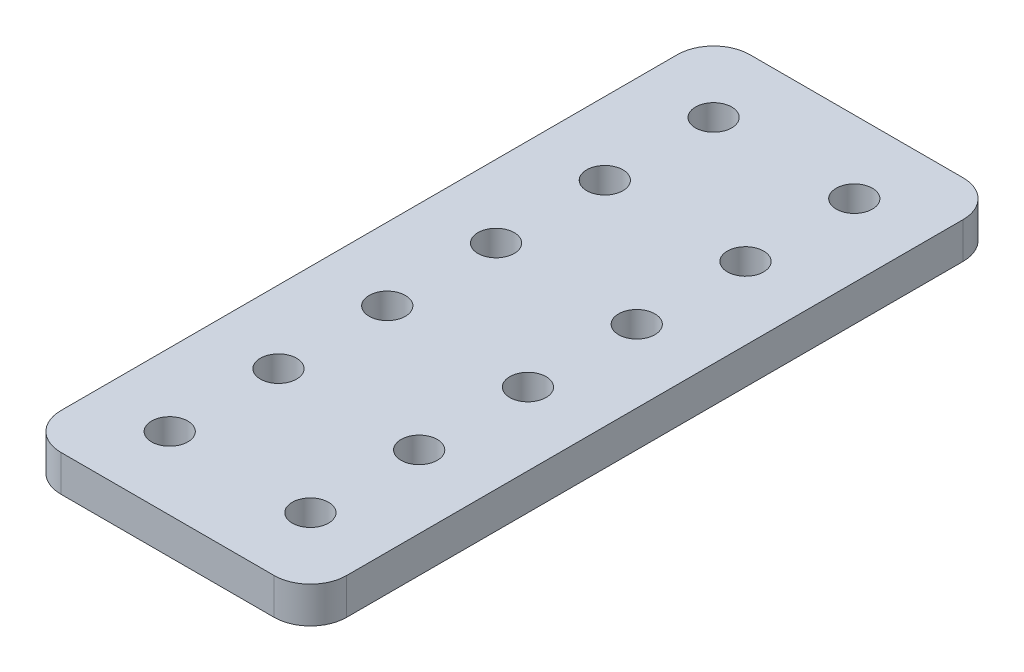
ISO-10303-21;
HEADER;
FILE_DESCRIPTION(('STEP AP214'),'2;1');
FILE_NAME('part.step','',(''),(''),'','','');
FILE_SCHEMA(('AUTOMOTIVE_DESIGN { 1 0 10303 214 1 1 1 1 }'));
ENDSEC;
DATA;
#1=APPLICATION_CONTEXT('core data for automotive mechanical design processes');
#2=APPLICATION_PROTOCOL_DEFINITION('international standard','automotive_design',2000,#1);
#3=PRODUCT_CONTEXT('',#1,'mechanical');
#4=PRODUCT('Part','Part','',(#3));
#5=PRODUCT_RELATED_PRODUCT_CATEGORY('part','',(#4));
#6=PRODUCT_DEFINITION_FORMATION('','',#4);
#7=PRODUCT_DEFINITION_CONTEXT('part definition',#1,'design');
#8=PRODUCT_DEFINITION('design','',#6,#7);
#9=PRODUCT_DEFINITION_SHAPE('','',#8);
#10=(LENGTH_UNIT() NAMED_UNIT(*) SI_UNIT(.MILLI.,.METRE.));
#11=(NAMED_UNIT(*) PLANE_ANGLE_UNIT() SI_UNIT($,.RADIAN.));
#12=(NAMED_UNIT(*) SI_UNIT($,.STERADIAN.) SOLID_ANGLE_UNIT());
#13=UNCERTAINTY_MEASURE_WITH_UNIT(LENGTH_MEASURE(1.E-05),#10,'distance_accuracy_value','');
#14=(GEOMETRIC_REPRESENTATION_CONTEXT(3) GLOBAL_UNCERTAINTY_ASSIGNED_CONTEXT((#13)) GLOBAL_UNIT_ASSIGNED_CONTEXT((#10,
#11,#12)) REPRESENTATION_CONTEXT('',''));
#15=CARTESIAN_POINT('',(0.,0.,0.));
#16=DIRECTION('',(0.,0.,1.));
#17=DIRECTION('',(1.,0.,0.));
#18=AXIS2_PLACEMENT_3D('',#15,#16,#17);
#19=CARTESIAN_POINT('',(0.,6.35,0.));
#20=DIRECTION('',(0.,-1.,0.));
#21=DIRECTION('',(0.,0.,-1.));
#22=AXIS2_PLACEMENT_3D('',#19,#20,#21);
#23=PLANE('',#22);
#24=DIRECTION('',(1.,0.,0.));
#25=VECTOR('',#24,1.);
#26=CARTESIAN_POINT('',(-25.019,6.35,60.325));
#27=LINE('',#26,#25);
#28=CARTESIAN_POINT('',(-18.669,6.35,60.325));
#29=VERTEX_POINT('',#28);
#30=CARTESIAN_POINT('',(18.669,6.35,60.325));
#31=VERTEX_POINT('',#30);
#32=EDGE_CURVE('E148',#29,#31,#27,.T.);
#33=ORIENTED_EDGE('',*,*,#32,.T.);
#34=CARTESIAN_POINT('',(18.669,6.35,53.975));
#35=DIRECTION('',(0.,-1.,0.));
#36=DIRECTION('',(0.,0.,-1.));
#37=AXIS2_PLACEMENT_3D('',#34,#35,#36);
#38=CIRCLE('',#37,6.35);
#39=CARTESIAN_POINT('',(25.019,6.35,53.975));
#40=VERTEX_POINT('',#39);
#41=EDGE_CURVE('E178',#31,#40,#38,.F.);
#42=ORIENTED_EDGE('',*,*,#41,.T.);
#43=DIRECTION('',(0.,0.,-1.));
#44=VECTOR('',#43,1.);
#45=CARTESIAN_POINT('',(25.019,6.35,60.325));
#46=LINE('',#45,#44);
#47=CARTESIAN_POINT('',(25.019,6.35,-53.975));
#48=VERTEX_POINT('',#47);
#49=EDGE_CURVE('E127',#40,#48,#46,.T.);
#50=ORIENTED_EDGE('',*,*,#49,.T.);
#51=CARTESIAN_POINT('',(18.669,6.35,-53.975));
#52=DIRECTION('',(0.,-1.,0.));
#53=DIRECTION('',(0.,0.,-1.));
#54=AXIS2_PLACEMENT_3D('',#51,#52,#53);
#55=CIRCLE('',#54,6.35);
#56=CARTESIAN_POINT('',(18.669,6.35,-60.325));
#57=VERTEX_POINT('',#56);
#58=EDGE_CURVE('E170',#48,#57,#55,.F.);
#59=ORIENTED_EDGE('',*,*,#58,.T.);
#60=DIRECTION('',(-1.,0.,0.));
#61=VECTOR('',#60,1.);
#62=CARTESIAN_POINT('',(-25.019,6.35,-60.325));
#63=LINE('',#62,#61);
#64=CARTESIAN_POINT('',(-18.669,6.35,-60.325));
#65=VERTEX_POINT('',#64);
#66=EDGE_CURVE('E193',#57,#65,#63,.T.);
#67=ORIENTED_EDGE('',*,*,#66,.T.);
#68=CARTESIAN_POINT('',(-18.669,6.35,-53.975));
#69=DIRECTION('',(0.,-1.,0.));
#70=DIRECTION('',(0.,0.,-1.));
#71=AXIS2_PLACEMENT_3D('',#68,#69,#70);
#72=CIRCLE('',#71,6.35);
#73=CARTESIAN_POINT('',(-25.019,6.35,-53.975));
#74=VERTEX_POINT('',#73);
#75=EDGE_CURVE('E62',#65,#74,#72,.F.);
#76=ORIENTED_EDGE('',*,*,#75,.T.);
#77=DIRECTION('',(0.,0.,1.));
#78=VECTOR('',#77,1.);
#79=CARTESIAN_POINT('',(-25.019,6.35,60.325));
#80=LINE('',#79,#78);
#81=CARTESIAN_POINT('',(-25.019,6.35,53.975));
#82=VERTEX_POINT('',#81);
#83=EDGE_CURVE('E201',#74,#82,#80,.T.);
#84=ORIENTED_EDGE('',*,*,#83,.T.);
#85=CARTESIAN_POINT('',(-18.669,6.35,53.975));
#86=DIRECTION('',(0.,-1.,0.));
#87=DIRECTION('',(0.,0.,-1.));
#88=AXIS2_PLACEMENT_3D('',#85,#86,#87);
#89=CIRCLE('',#88,6.35);
#90=EDGE_CURVE('E175',#82,#29,#89,.F.);
#91=ORIENTED_EDGE('',*,*,#90,.T.);
#92=EDGE_LOOP('',(#33,#42,#50,#59,#67,#76,#84,#91));
#93=FACE_BOUND('',#92,.T.);
#94=CARTESIAN_POINT('',(12.319,6.35,47.625));
#95=DIRECTION('',(0.,1.,0.));
#96=DIRECTION('',(0.,0.,1.));
#97=AXIS2_PLACEMENT_3D('',#94,#95,#96);
#98=CIRCLE('',#97,3.175);
#99=CARTESIAN_POINT('',(12.319,6.35,50.8));
#100=VERTEX_POINT('',#99);
#101=EDGE_CURVE('E137',#100,#100,#98,.T.);
#102=ORIENTED_EDGE('',*,*,#101,.F.);
#103=EDGE_LOOP('',(#102));
#104=FACE_BOUND('',#103,.T.);
#105=CARTESIAN_POINT('',(-12.319,6.35,47.625));
#106=DIRECTION('',(0.,1.,0.));
#107=DIRECTION('',(0.,0.,1.));
#108=AXIS2_PLACEMENT_3D('',#105,#106,#107);
#109=CIRCLE('',#108,3.175);
#110=CARTESIAN_POINT('',(-12.319,6.35,50.8));
#111=VERTEX_POINT('',#110);
#112=EDGE_CURVE('E213',#111,#111,#109,.T.);
#113=ORIENTED_EDGE('',*,*,#112,.F.);
#114=EDGE_LOOP('',(#113));
#115=FACE_BOUND('',#114,.T.);
#116=CARTESIAN_POINT('',(12.3189999999999,6.35,28.575));
#117=DIRECTION('',(0.,1.,0.));
#118=DIRECTION('',(0.,0.,1.));
#119=AXIS2_PLACEMENT_3D('',#116,#117,#118);
#120=CIRCLE('',#119,3.175);
#121=CARTESIAN_POINT('',(12.3189999999999,6.35,31.75));
#122=VERTEX_POINT('',#121);
#123=EDGE_CURVE('E219',#122,#122,#120,.T.);
#124=ORIENTED_EDGE('',*,*,#123,.F.);
#125=EDGE_LOOP('',(#124));
#126=FACE_BOUND('',#125,.T.);
#127=CARTESIAN_POINT('',(-12.3190000000001,6.35,28.575));
#128=DIRECTION('',(0.,1.,0.));
#129=DIRECTION('',(0.,0.,1.));
#130=AXIS2_PLACEMENT_3D('',#127,#128,#129);
#131=CIRCLE('',#130,3.175);
#132=CARTESIAN_POINT('',(-12.3190000000001,6.35,31.75));
#133=VERTEX_POINT('',#132);
#134=EDGE_CURVE('E227',#133,#133,#131,.T.);
#135=ORIENTED_EDGE('',*,*,#134,.F.);
#136=EDGE_LOOP('',(#135));
#137=FACE_BOUND('',#136,.T.);
#138=CARTESIAN_POINT('',(12.3189999999999,6.35,9.525));
#139=DIRECTION('',(0.,1.,0.));
#140=DIRECTION('',(0.,0.,1.));
#141=AXIS2_PLACEMENT_3D('',#138,#139,#140);
#142=CIRCLE('',#141,3.175);
#143=CARTESIAN_POINT('',(12.3189999999999,6.35,12.7));
#144=VERTEX_POINT('',#143);
#145=EDGE_CURVE('E235',#144,#144,#142,.T.);
#146=ORIENTED_EDGE('',*,*,#145,.F.);
#147=EDGE_LOOP('',(#146));
#148=FACE_BOUND('',#147,.T.);
#149=CARTESIAN_POINT('',(-12.3190000000001,6.35,9.525));
#150=DIRECTION('',(0.,1.,0.));
#151=DIRECTION('',(0.,0.,1.));
#152=AXIS2_PLACEMENT_3D('',#149,#150,#151);
#153=CIRCLE('',#152,3.175);
#154=CARTESIAN_POINT('',(-12.3190000000001,6.35,12.7));
#155=VERTEX_POINT('',#154);
#156=EDGE_CURVE('E243',#155,#155,#153,.T.);
#157=ORIENTED_EDGE('',*,*,#156,.F.);
#158=EDGE_LOOP('',(#157));
#159=FACE_BOUND('',#158,.T.);
#160=CARTESIAN_POINT('',(12.3189999999998,6.35,-9.52500000000001));
#161=DIRECTION('',(0.,1.,0.));
#162=DIRECTION('',(0.,0.,1.));
#163=AXIS2_PLACEMENT_3D('',#160,#161,#162);
#164=CIRCLE('',#163,3.175);
#165=CARTESIAN_POINT('',(12.3189999999998,6.35,-6.35));
#166=VERTEX_POINT('',#165);
#167=EDGE_CURVE('E251',#166,#166,#164,.T.);
#168=ORIENTED_EDGE('',*,*,#167,.F.);
#169=EDGE_LOOP('',(#168));
#170=FACE_BOUND('',#169,.T.);
#171=CARTESIAN_POINT('',(-12.3190000000002,6.35,-9.52500000000001));
#172=DIRECTION('',(0.,1.,0.));
#173=DIRECTION('',(0.,0.,1.));
#174=AXIS2_PLACEMENT_3D('',#171,#172,#173);
#175=CIRCLE('',#174,3.175);
#176=CARTESIAN_POINT('',(-12.3190000000002,6.35,-6.35));
#177=VERTEX_POINT('',#176);
#178=EDGE_CURVE('E259',#177,#177,#175,.T.);
#179=ORIENTED_EDGE('',*,*,#178,.F.);
#180=EDGE_LOOP('',(#179));
#181=FACE_BOUND('',#180,.T.);
#182=CARTESIAN_POINT('',(12.3189999999997,6.35,-28.575));
#183=DIRECTION('',(0.,1.,0.));
#184=DIRECTION('',(0.,0.,1.));
#185=AXIS2_PLACEMENT_3D('',#182,#183,#184);
#186=CIRCLE('',#185,3.175);
#187=CARTESIAN_POINT('',(12.3189999999997,6.35,-25.4));
#188=VERTEX_POINT('',#187);
#189=EDGE_CURVE('E267',#188,#188,#186,.T.);
#190=ORIENTED_EDGE('',*,*,#189,.F.);
#191=EDGE_LOOP('',(#190));
#192=FACE_BOUND('',#191,.T.);
#193=CARTESIAN_POINT('',(-12.3190000000003,6.35,-28.575));
#194=DIRECTION('',(0.,1.,0.));
#195=DIRECTION('',(0.,0.,1.));
#196=AXIS2_PLACEMENT_3D('',#193,#194,#195);
#197=CIRCLE('',#196,3.175);
#198=CARTESIAN_POINT('',(-12.3190000000003,6.35,-25.4));
#199=VERTEX_POINT('',#198);
#200=EDGE_CURVE('E275',#199,#199,#197,.T.);
#201=ORIENTED_EDGE('',*,*,#200,.F.);
#202=EDGE_LOOP('',(#201));
#203=FACE_BOUND('',#202,.T.);
#204=CARTESIAN_POINT('',(12.3189999999997,6.35,-47.625));
#205=DIRECTION('',(0.,1.,0.));
#206=DIRECTION('',(0.,0.,1.));
#207=AXIS2_PLACEMENT_3D('',#204,#205,#206);
#208=CIRCLE('',#207,3.175);
#209=CARTESIAN_POINT('',(12.3189999999997,6.35,-44.45));
#210=VERTEX_POINT('',#209);
#211=EDGE_CURVE('E283',#210,#210,#208,.T.);
#212=ORIENTED_EDGE('',*,*,#211,.F.);
#213=EDGE_LOOP('',(#212));
#214=FACE_BOUND('',#213,.T.);
#215=CARTESIAN_POINT('',(-12.3190000000003,6.35,-47.625));
#216=DIRECTION('',(0.,1.,0.));
#217=DIRECTION('',(0.,0.,1.));
#218=AXIS2_PLACEMENT_3D('',#215,#216,#217);
#219=CIRCLE('',#218,3.175);
#220=CARTESIAN_POINT('',(-12.3190000000003,6.35,-44.45));
#221=VERTEX_POINT('',#220);
#222=EDGE_CURVE('E291',#221,#221,#219,.T.);
#223=ORIENTED_EDGE('',*,*,#222,.F.);
#224=EDGE_LOOP('',(#223));
#225=FACE_BOUND('',#224,.T.);
#226=ADVANCED_FACE('F39',(#93,#104,#115,#126,#137,#148,#159,#170,#181,#192,#203,#214,#225),#23,.F.);
#227=CARTESIAN_POINT('',(0.,0.,0.));
#228=DIRECTION('',(0.,-1.,0.));
#229=DIRECTION('',(0.,0.,-1.));
#230=AXIS2_PLACEMENT_3D('',#227,#228,#229);
#231=PLANE('',#230);
#232=CARTESIAN_POINT('',(12.3189999999997,0.,-47.625));
#233=DIRECTION('',(0.,1.,0.));
#234=DIRECTION('',(0.,0.,1.));
#235=AXIS2_PLACEMENT_3D('',#232,#233,#234);
#236=CIRCLE('',#235,3.175);
#237=CARTESIAN_POINT('',(12.3189999999997,0.,-44.45));
#238=VERTEX_POINT('',#237);
#239=EDGE_CURVE('E287',#238,#238,#236,.T.);
#240=ORIENTED_EDGE('',*,*,#239,.T.);
#241=EDGE_LOOP('',(#240));
#242=FACE_BOUND('',#241,.T.);
#243=CARTESIAN_POINT('',(12.3189999999997,0.,-28.575));
#244=DIRECTION('',(0.,1.,0.));
#245=DIRECTION('',(0.,0.,1.));
#246=AXIS2_PLACEMENT_3D('',#243,#244,#245);
#247=CIRCLE('',#246,3.175);
#248=CARTESIAN_POINT('',(12.3189999999997,0.,-25.4));
#249=VERTEX_POINT('',#248);
#250=EDGE_CURVE('E271',#249,#249,#247,.T.);
#251=ORIENTED_EDGE('',*,*,#250,.T.);
#252=EDGE_LOOP('',(#251));
#253=FACE_BOUND('',#252,.T.);
#254=CARTESIAN_POINT('',(12.3189999999998,0.,-9.52500000000001));
#255=DIRECTION('',(0.,1.,0.));
#256=DIRECTION('',(0.,0.,1.));
#257=AXIS2_PLACEMENT_3D('',#254,#255,#256);
#258=CIRCLE('',#257,3.175);
#259=CARTESIAN_POINT('',(12.3189999999998,0.,-6.35));
#260=VERTEX_POINT('',#259);
#261=EDGE_CURVE('E255',#260,#260,#258,.T.);
#262=ORIENTED_EDGE('',*,*,#261,.T.);
#263=EDGE_LOOP('',(#262));
#264=FACE_BOUND('',#263,.T.);
#265=CARTESIAN_POINT('',(12.3189999999999,0.,9.525));
#266=DIRECTION('',(0.,1.,0.));
#267=DIRECTION('',(0.,0.,1.));
#268=AXIS2_PLACEMENT_3D('',#265,#266,#267);
#269=CIRCLE('',#268,3.175);
#270=CARTESIAN_POINT('',(12.3189999999999,0.,12.7));
#271=VERTEX_POINT('',#270);
#272=EDGE_CURVE('E239',#271,#271,#269,.T.);
#273=ORIENTED_EDGE('',*,*,#272,.T.);
#274=EDGE_LOOP('',(#273));
#275=FACE_BOUND('',#274,.T.);
#276=CARTESIAN_POINT('',(12.3189999999999,0.,28.575));
#277=DIRECTION('',(0.,1.,0.));
#278=DIRECTION('',(0.,0.,1.));
#279=AXIS2_PLACEMENT_3D('',#276,#277,#278);
#280=CIRCLE('',#279,3.175);
#281=CARTESIAN_POINT('',(12.3189999999999,0.,31.75));
#282=VERTEX_POINT('',#281);
#283=EDGE_CURVE('E223',#282,#282,#280,.T.);
#284=ORIENTED_EDGE('',*,*,#283,.T.);
#285=EDGE_LOOP('',(#284));
#286=FACE_BOUND('',#285,.T.);
#287=CARTESIAN_POINT('',(12.319,0.,47.625));
#288=DIRECTION('',(0.,1.,0.));
#289=DIRECTION('',(0.,0.,1.));
#290=AXIS2_PLACEMENT_3D('',#287,#288,#289);
#291=CIRCLE('',#290,3.175);
#292=CARTESIAN_POINT('',(12.319,0.,50.8));
#293=VERTEX_POINT('',#292);
#294=EDGE_CURVE('E145',#293,#293,#291,.T.);
#295=ORIENTED_EDGE('',*,*,#294,.T.);
#296=EDGE_LOOP('',(#295));
#297=FACE_BOUND('',#296,.T.);
#298=DIRECTION('',(0.,0.,-1.));
#299=VECTOR('',#298,1.);
#300=CARTESIAN_POINT('',(25.019,0.,60.325));
#301=LINE('',#300,#299);
#302=CARTESIAN_POINT('',(25.019,0.,53.975));
#303=VERTEX_POINT('',#302);
#304=CARTESIAN_POINT('',(25.019,0.,-53.975));
#305=VERTEX_POINT('',#304);
#306=EDGE_CURVE('E124',#303,#305,#301,.T.);
#307=ORIENTED_EDGE('',*,*,#306,.F.);
#308=CARTESIAN_POINT('',(18.669,0.,53.975));
#309=DIRECTION('',(0.,-1.,0.));
#310=DIRECTION('',(0.,0.,-1.));
#311=AXIS2_PLACEMENT_3D('',#308,#309,#310);
#312=CIRCLE('',#311,6.35);
#313=CARTESIAN_POINT('',(18.669,0.,60.325));
#314=VERTEX_POINT('',#313);
#315=EDGE_CURVE('E106',#303,#314,#312,.T.);
#316=ORIENTED_EDGE('',*,*,#315,.T.);
#317=DIRECTION('',(1.,0.,0.));
#318=VECTOR('',#317,1.);
#319=CARTESIAN_POINT('',(-25.019,0.,60.325));
#320=LINE('',#319,#318);
#321=CARTESIAN_POINT('',(-18.669,0.,60.325));
#322=VERTEX_POINT('',#321);
#323=EDGE_CURVE('E153',#322,#314,#320,.T.);
#324=ORIENTED_EDGE('',*,*,#323,.F.);
#325=CARTESIAN_POINT('',(-18.669,0.,53.975));
#326=DIRECTION('',(0.,-1.,0.));
#327=DIRECTION('',(0.,0.,-1.));
#328=AXIS2_PLACEMENT_3D('',#325,#326,#327);
#329=CIRCLE('',#328,6.35);
#330=CARTESIAN_POINT('',(-25.019,0.,53.975));
#331=VERTEX_POINT('',#330);
#332=EDGE_CURVE('E118',#322,#331,#329,.T.);
#333=ORIENTED_EDGE('',*,*,#332,.T.);
#334=DIRECTION('',(0.,0.,1.));
#335=VECTOR('',#334,1.);
#336=CARTESIAN_POINT('',(-25.019,0.,60.325));
#337=LINE('',#336,#335);
#338=CARTESIAN_POINT('',(-25.019,0.,-53.975));
#339=VERTEX_POINT('',#338);
#340=EDGE_CURVE('E142',#339,#331,#337,.T.);
#341=ORIENTED_EDGE('',*,*,#340,.F.);
#342=CARTESIAN_POINT('',(-18.669,0.,-53.975));
#343=DIRECTION('',(0.,-1.,0.));
#344=DIRECTION('',(0.,0.,-1.));
#345=AXIS2_PLACEMENT_3D('',#342,#343,#344);
#346=CIRCLE('',#345,6.35);
#347=CARTESIAN_POINT('',(-18.669,0.,-60.325));
#348=VERTEX_POINT('',#347);
#349=EDGE_CURVE('E160',#339,#348,#346,.T.);
#350=ORIENTED_EDGE('',*,*,#349,.T.);
#351=DIRECTION('',(-1.,0.,0.));
#352=VECTOR('',#351,1.);
#353=CARTESIAN_POINT('',(-25.019,0.,-60.325));
#354=LINE('',#353,#352);
#355=CARTESIAN_POINT('',(18.669,0.,-60.325));
#356=VERTEX_POINT('',#355);
#357=EDGE_CURVE('E136',#356,#348,#354,.T.);
#358=ORIENTED_EDGE('',*,*,#357,.F.);
#359=CARTESIAN_POINT('',(18.669,0.,-53.975));
#360=DIRECTION('',(0.,-1.,0.));
#361=DIRECTION('',(0.,0.,-1.));
#362=AXIS2_PLACEMENT_3D('',#359,#360,#361);
#363=CIRCLE('',#362,6.35);
#364=EDGE_CURVE('E129',#356,#305,#363,.T.);
#365=ORIENTED_EDGE('',*,*,#364,.T.);
#366=EDGE_LOOP('',(#307,#316,#324,#333,#341,#350,#358,#365));
#367=FACE_BOUND('',#366,.T.);
#368=CARTESIAN_POINT('',(-12.319,0.,47.625));
#369=DIRECTION('',(0.,1.,0.));
#370=DIRECTION('',(0.,0.,1.));
#371=AXIS2_PLACEMENT_3D('',#368,#369,#370);
#372=CIRCLE('',#371,3.175);
#373=CARTESIAN_POINT('',(-12.319,0.,50.8));
#374=VERTEX_POINT('',#373);
#375=EDGE_CURVE('E215',#374,#374,#372,.T.);
#376=ORIENTED_EDGE('',*,*,#375,.T.);
#377=EDGE_LOOP('',(#376));
#378=FACE_BOUND('',#377,.T.);
#379=CARTESIAN_POINT('',(-12.3190000000001,0.,28.575));
#380=DIRECTION('',(0.,1.,0.));
#381=DIRECTION('',(0.,0.,1.));
#382=AXIS2_PLACEMENT_3D('',#379,#380,#381);
#383=CIRCLE('',#382,3.175);
#384=CARTESIAN_POINT('',(-12.3190000000001,0.,31.75));
#385=VERTEX_POINT('',#384);
#386=EDGE_CURVE('E231',#385,#385,#383,.T.);
#387=ORIENTED_EDGE('',*,*,#386,.T.);
#388=EDGE_LOOP('',(#387));
#389=FACE_BOUND('',#388,.T.);
#390=CARTESIAN_POINT('',(-12.3190000000001,0.,9.525));
#391=DIRECTION('',(0.,1.,0.));
#392=DIRECTION('',(0.,0.,1.));
#393=AXIS2_PLACEMENT_3D('',#390,#391,#392);
#394=CIRCLE('',#393,3.175);
#395=CARTESIAN_POINT('',(-12.3190000000001,0.,12.7));
#396=VERTEX_POINT('',#395);
#397=EDGE_CURVE('E247',#396,#396,#394,.T.);
#398=ORIENTED_EDGE('',*,*,#397,.T.);
#399=EDGE_LOOP('',(#398));
#400=FACE_BOUND('',#399,.T.);
#401=CARTESIAN_POINT('',(-12.3190000000002,0.,-9.52500000000001));
#402=DIRECTION('',(0.,1.,0.));
#403=DIRECTION('',(0.,0.,1.));
#404=AXIS2_PLACEMENT_3D('',#401,#402,#403);
#405=CIRCLE('',#404,3.175);
#406=CARTESIAN_POINT('',(-12.3190000000002,0.,-6.35));
#407=VERTEX_POINT('',#406);
#408=EDGE_CURVE('E263',#407,#407,#405,.T.);
#409=ORIENTED_EDGE('',*,*,#408,.T.);
#410=EDGE_LOOP('',(#409));
#411=FACE_BOUND('',#410,.T.);
#412=CARTESIAN_POINT('',(-12.3190000000003,0.,-28.575));
#413=DIRECTION('',(0.,1.,0.));
#414=DIRECTION('',(0.,0.,1.));
#415=AXIS2_PLACEMENT_3D('',#412,#413,#414);
#416=CIRCLE('',#415,3.175);
#417=CARTESIAN_POINT('',(-12.3190000000003,0.,-25.4));
#418=VERTEX_POINT('',#417);
#419=EDGE_CURVE('E279',#418,#418,#416,.T.);
#420=ORIENTED_EDGE('',*,*,#419,.T.);
#421=EDGE_LOOP('',(#420));
#422=FACE_BOUND('',#421,.T.);
#423=CARTESIAN_POINT('',(-12.3190000000003,0.,-47.625));
#424=DIRECTION('',(0.,1.,0.));
#425=DIRECTION('',(0.,0.,1.));
#426=AXIS2_PLACEMENT_3D('',#423,#424,#425);
#427=CIRCLE('',#426,3.175);
#428=CARTESIAN_POINT('',(-12.3190000000003,0.,-44.45));
#429=VERTEX_POINT('',#428);
#430=EDGE_CURVE('E295',#429,#429,#427,.T.);
#431=ORIENTED_EDGE('',*,*,#430,.T.);
#432=EDGE_LOOP('',(#431));
#433=FACE_BOUND('',#432,.T.);
#434=ADVANCED_FACE('F132',(#242,#253,#264,#275,#286,#297,#367,#378,#389,#400,#411,#422,#433),
#231,.T.);
#435=CARTESIAN_POINT('',(25.019,6.35,60.325));
#436=DIRECTION('',(-1.,0.,0.));
#437=DIRECTION('',(0.,0.,1.));
#438=AXIS2_PLACEMENT_3D('',#435,#436,#437);
#439=PLANE('',#438);
#440=ORIENTED_EDGE('',*,*,#49,.F.);
#441=DIRECTION('',(0.,-1.,0.));
#442=VECTOR('',#441,1.);
#443=CARTESIAN_POINT('',(25.019,6.35,53.975));
#444=LINE('',#443,#442);
#445=EDGE_CURVE('E110',#40,#303,#444,.T.);
#446=ORIENTED_EDGE('',*,*,#445,.T.);
#447=ORIENTED_EDGE('',*,*,#306,.T.);
#448=DIRECTION('',(0.,-1.,0.));
#449=VECTOR('',#448,1.);
#450=CARTESIAN_POINT('',(25.019,6.35,-53.975));
#451=LINE('',#450,#449);
#452=EDGE_CURVE('E130',#305,#48,#451,.F.);
#453=ORIENTED_EDGE('',*,*,#452,.T.);
#454=EDGE_LOOP('',(#440,#446,#447,#453));
#455=FACE_BOUND('',#454,.T.);
#456=ADVANCED_FACE('F123',(#455),#439,.F.);
#457=CARTESIAN_POINT('',(-25.019,6.35,-60.325));
#458=DIRECTION('',(0.,0.,1.));
#459=DIRECTION('',(1.,0.,0.));
#460=AXIS2_PLACEMENT_3D('',#457,#458,#459);
#461=PLANE('',#460);
#462=ORIENTED_EDGE('',*,*,#357,.T.);
#463=DIRECTION('',(0.,-1.,0.));
#464=VECTOR('',#463,1.);
#465=CARTESIAN_POINT('',(-18.669,6.35,-60.325));
#466=LINE('',#465,#464);
#467=EDGE_CURVE('E11',#348,#65,#466,.F.);
#468=ORIENTED_EDGE('',*,*,#467,.T.);
#469=ORIENTED_EDGE('',*,*,#66,.F.);
#470=DIRECTION('',(0.,-1.,0.));
#471=VECTOR('',#470,1.);
#472=CARTESIAN_POINT('',(18.669,6.35,-60.325));
#473=LINE('',#472,#471);
#474=EDGE_CURVE('E48',#57,#356,#473,.T.);
#475=ORIENTED_EDGE('',*,*,#474,.T.);
#476=EDGE_LOOP('',(#462,#468,#469,#475));
#477=FACE_BOUND('',#476,.T.);
#478=ADVANCED_FACE('F191',(#477),#461,.F.);
#479=CARTESIAN_POINT('',(-25.019,6.35,60.325));
#480=DIRECTION('',(1.,0.,0.));
#481=DIRECTION('',(0.,0.,-1.));
#482=AXIS2_PLACEMENT_3D('',#479,#480,#481);
#483=PLANE('',#482);
#484=ORIENTED_EDGE('',*,*,#340,.T.);
#485=DIRECTION('',(0.,-1.,0.));
#486=VECTOR('',#485,1.);
#487=CARTESIAN_POINT('',(-25.019,6.35,53.975));
#488=LINE('',#487,#486);
#489=EDGE_CURVE('E55',#331,#82,#488,.F.);
#490=ORIENTED_EDGE('',*,*,#489,.T.);
#491=ORIENTED_EDGE('',*,*,#83,.F.);
#492=DIRECTION('',(0.,-1.,0.));
#493=VECTOR('',#492,1.);
#494=CARTESIAN_POINT('',(-25.019,6.35,-53.975));
#495=LINE('',#494,#493);
#496=EDGE_CURVE('E181',#74,#339,#495,.T.);
#497=ORIENTED_EDGE('',*,*,#496,.T.);
#498=EDGE_LOOP('',(#484,#490,#491,#497));
#499=FACE_BOUND('',#498,.T.);
#500=ADVANCED_FACE('F200',(#499),#483,.F.);
#501=CARTESIAN_POINT('',(-25.019,6.35,60.325));
#502=DIRECTION('',(0.,0.,-1.));
#503=DIRECTION('',(-1.,0.,0.));
#504=AXIS2_PLACEMENT_3D('',#501,#502,#503);
#505=PLANE('',#504);
#506=ORIENTED_EDGE('',*,*,#323,.T.);
#507=DIRECTION('',(0.,-1.,0.));
#508=VECTOR('',#507,1.);
#509=CARTESIAN_POINT('',(18.669,6.35,60.325));
#510=LINE('',#509,#508);
#511=EDGE_CURVE('E111',#314,#31,#510,.F.);
#512=ORIENTED_EDGE('',*,*,#511,.T.);
#513=ORIENTED_EDGE('',*,*,#32,.F.);
#514=DIRECTION('',(0.,-1.,0.));
#515=VECTOR('',#514,1.);
#516=CARTESIAN_POINT('',(-18.669,6.35,60.325));
#517=LINE('',#516,#515);
#518=EDGE_CURVE('E117',#29,#322,#517,.T.);
#519=ORIENTED_EDGE('',*,*,#518,.T.);
#520=EDGE_LOOP('',(#506,#512,#513,#519));
#521=FACE_BOUND('',#520,.T.);
#522=ADVANCED_FACE('F318',(#521),#505,.F.);
#523=CARTESIAN_POINT('',(12.319,6.35,47.625));
#524=DIRECTION('',(0.,-1.,0.));
#525=DIRECTION('',(0.,0.,-1.));
#526=AXIS2_PLACEMENT_3D('',#523,#524,#525);
#527=CYLINDRICAL_SURFACE('',#526,3.175);
#528=ORIENTED_EDGE('',*,*,#101,.T.);
#529=EDGE_LOOP('',(#528));
#530=FACE_BOUND('',#529,.T.);
#531=ORIENTED_EDGE('',*,*,#294,.F.);
#532=EDGE_LOOP('',(#531));
#533=FACE_BOUND('',#532,.T.);
#534=ADVANCED_FACE('F315',(#530,#533),#527,.F.);
#535=CARTESIAN_POINT('',(-12.319,6.35,47.625));
#536=DIRECTION('',(0.,-1.,0.));
#537=DIRECTION('',(0.,0.,-1.));
#538=AXIS2_PLACEMENT_3D('',#535,#536,#537);
#539=CYLINDRICAL_SURFACE('',#538,3.175);
#540=ORIENTED_EDGE('',*,*,#112,.T.);
#541=EDGE_LOOP('',(#540));
#542=FACE_BOUND('',#541,.T.);
#543=ORIENTED_EDGE('',*,*,#375,.F.);
#544=EDGE_LOOP('',(#543));
#545=FACE_BOUND('',#544,.T.);
#546=ADVANCED_FACE('F491',(#542,#545),#539,.F.);
#547=CARTESIAN_POINT('',(12.3189999999999,6.35,28.575));
#548=DIRECTION('',(0.,-1.,0.));
#549=DIRECTION('',(0.,0.,-1.));
#550=AXIS2_PLACEMENT_3D('',#547,#548,#549);
#551=CYLINDRICAL_SURFACE('',#550,3.175);
#552=ORIENTED_EDGE('',*,*,#123,.T.);
#553=EDGE_LOOP('',(#552));
#554=FACE_BOUND('',#553,.T.);
#555=ORIENTED_EDGE('',*,*,#283,.F.);
#556=EDGE_LOOP('',(#555));
#557=FACE_BOUND('',#556,.T.);
#558=ADVANCED_FACE('F481',(#554,#557),#551,.F.);
#559=CARTESIAN_POINT('',(-12.3190000000001,6.35,28.575));
#560=DIRECTION('',(0.,-1.,0.));
#561=DIRECTION('',(0.,0.,-1.));
#562=AXIS2_PLACEMENT_3D('',#559,#560,#561);
#563=CYLINDRICAL_SURFACE('',#562,3.175);
#564=ORIENTED_EDGE('',*,*,#134,.T.);
#565=EDGE_LOOP('',(#564));
#566=FACE_BOUND('',#565,.T.);
#567=ORIENTED_EDGE('',*,*,#386,.F.);
#568=EDGE_LOOP('',(#567));
#569=FACE_BOUND('',#568,.T.);
#570=ADVANCED_FACE('F471',(#566,#569),#563,.F.);
#571=CARTESIAN_POINT('',(12.3189999999999,6.35,9.525));
#572=DIRECTION('',(0.,-1.,0.));
#573=DIRECTION('',(0.,0.,-1.));
#574=AXIS2_PLACEMENT_3D('',#571,#572,#573);
#575=CYLINDRICAL_SURFACE('',#574,3.175);
#576=ORIENTED_EDGE('',*,*,#145,.T.);
#577=EDGE_LOOP('',(#576));
#578=FACE_BOUND('',#577,.T.);
#579=ORIENTED_EDGE('',*,*,#272,.F.);
#580=EDGE_LOOP('',(#579));
#581=FACE_BOUND('',#580,.T.);
#582=ADVANCED_FACE('F461',(#578,#581),#575,.F.);
#583=CARTESIAN_POINT('',(-12.3190000000001,6.35,9.525));
#584=DIRECTION('',(0.,-1.,0.));
#585=DIRECTION('',(0.,0.,-1.));
#586=AXIS2_PLACEMENT_3D('',#583,#584,#585);
#587=CYLINDRICAL_SURFACE('',#586,3.175);
#588=ORIENTED_EDGE('',*,*,#156,.T.);
#589=EDGE_LOOP('',(#588));
#590=FACE_BOUND('',#589,.T.);
#591=ORIENTED_EDGE('',*,*,#397,.F.);
#592=EDGE_LOOP('',(#591));
#593=FACE_BOUND('',#592,.T.);
#594=ADVANCED_FACE('F451',(#590,#593),#587,.F.);
#595=CARTESIAN_POINT('',(12.3189999999998,6.35,-9.52500000000001));
#596=DIRECTION('',(0.,-1.,0.));
#597=DIRECTION('',(0.,0.,-1.));
#598=AXIS2_PLACEMENT_3D('',#595,#596,#597);
#599=CYLINDRICAL_SURFACE('',#598,3.175);
#600=ORIENTED_EDGE('',*,*,#167,.T.);
#601=EDGE_LOOP('',(#600));
#602=FACE_BOUND('',#601,.T.);
#603=ORIENTED_EDGE('',*,*,#261,.F.);
#604=EDGE_LOOP('',(#603));
#605=FACE_BOUND('',#604,.T.);
#606=ADVANCED_FACE('F441',(#602,#605),#599,.F.);
#607=CARTESIAN_POINT('',(-12.3190000000002,6.35,-9.52500000000001));
#608=DIRECTION('',(0.,-1.,0.));
#609=DIRECTION('',(0.,0.,-1.));
#610=AXIS2_PLACEMENT_3D('',#607,#608,#609);
#611=CYLINDRICAL_SURFACE('',#610,3.175);
#612=ORIENTED_EDGE('',*,*,#178,.T.);
#613=EDGE_LOOP('',(#612));
#614=FACE_BOUND('',#613,.T.);
#615=ORIENTED_EDGE('',*,*,#408,.F.);
#616=EDGE_LOOP('',(#615));
#617=FACE_BOUND('',#616,.T.);
#618=ADVANCED_FACE('F431',(#614,#617),#611,.F.);
#619=CARTESIAN_POINT('',(12.3189999999997,6.35,-28.575));
#620=DIRECTION('',(0.,-1.,0.));
#621=DIRECTION('',(0.,0.,-1.));
#622=AXIS2_PLACEMENT_3D('',#619,#620,#621);
#623=CYLINDRICAL_SURFACE('',#622,3.175);
#624=ORIENTED_EDGE('',*,*,#189,.T.);
#625=EDGE_LOOP('',(#624));
#626=FACE_BOUND('',#625,.T.);
#627=ORIENTED_EDGE('',*,*,#250,.F.);
#628=EDGE_LOOP('',(#627));
#629=FACE_BOUND('',#628,.T.);
#630=ADVANCED_FACE('F421',(#626,#629),#623,.F.);
#631=CARTESIAN_POINT('',(-12.3190000000003,6.35,-28.575));
#632=DIRECTION('',(0.,-1.,0.));
#633=DIRECTION('',(0.,0.,-1.));
#634=AXIS2_PLACEMENT_3D('',#631,#632,#633);
#635=CYLINDRICAL_SURFACE('',#634,3.175);
#636=ORIENTED_EDGE('',*,*,#200,.T.);
#637=EDGE_LOOP('',(#636));
#638=FACE_BOUND('',#637,.T.);
#639=ORIENTED_EDGE('',*,*,#419,.F.);
#640=EDGE_LOOP('',(#639));
#641=FACE_BOUND('',#640,.T.);
#642=ADVANCED_FACE('F411',(#638,#641),#635,.F.);
#643=CARTESIAN_POINT('',(12.3189999999997,6.35,-47.625));
#644=DIRECTION('',(0.,-1.,0.));
#645=DIRECTION('',(0.,0.,-1.));
#646=AXIS2_PLACEMENT_3D('',#643,#644,#645);
#647=CYLINDRICAL_SURFACE('',#646,3.175);
#648=ORIENTED_EDGE('',*,*,#211,.T.);
#649=EDGE_LOOP('',(#648));
#650=FACE_BOUND('',#649,.T.);
#651=ORIENTED_EDGE('',*,*,#239,.F.);
#652=EDGE_LOOP('',(#651));
#653=FACE_BOUND('',#652,.T.);
#654=ADVANCED_FACE('F402',(#650,#653),#647,.F.);
#655=CARTESIAN_POINT('',(-12.3190000000003,6.35,-47.625));
#656=DIRECTION('',(0.,-1.,0.));
#657=DIRECTION('',(0.,0.,-1.));
#658=AXIS2_PLACEMENT_3D('',#655,#656,#657);
#659=CYLINDRICAL_SURFACE('',#658,3.175);
#660=ORIENTED_EDGE('',*,*,#222,.T.);
#661=EDGE_LOOP('',(#660));
#662=FACE_BOUND('',#661,.T.);
#663=ORIENTED_EDGE('',*,*,#430,.F.);
#664=EDGE_LOOP('',(#663));
#665=FACE_BOUND('',#664,.T.);
#666=ADVANCED_FACE('F303',(#662,#665),#659,.F.);
#667=CARTESIAN_POINT('',(18.669,6.35,53.975));
#668=DIRECTION('',(0.,-1.,0.));
#669=DIRECTION('',(0.,0.,-1.));
#670=AXIS2_PLACEMENT_3D('',#667,#668,#669);
#671=CYLINDRICAL_SURFACE('',#670,6.35);
#672=ORIENTED_EDGE('',*,*,#41,.F.);
#673=ORIENTED_EDGE('',*,*,#511,.F.);
#674=ORIENTED_EDGE('',*,*,#315,.F.);
#675=ORIENTED_EDGE('',*,*,#445,.F.);
#676=EDGE_LOOP('',(#672,#673,#674,#675));
#677=FACE_BOUND('',#676,.T.);
#678=ADVANCED_FACE('F109',(#677),#671,.T.);
#679=CARTESIAN_POINT('',(-18.669,6.35,53.975));
#680=DIRECTION('',(0.,-1.,0.));
#681=DIRECTION('',(0.,0.,-1.));
#682=AXIS2_PLACEMENT_3D('',#679,#680,#681);
#683=CYLINDRICAL_SURFACE('',#682,6.35);
#684=ORIENTED_EDGE('',*,*,#90,.F.);
#685=ORIENTED_EDGE('',*,*,#489,.F.);
#686=ORIENTED_EDGE('',*,*,#332,.F.);
#687=ORIENTED_EDGE('',*,*,#518,.F.);
#688=EDGE_LOOP('',(#684,#685,#686,#687));
#689=FACE_BOUND('',#688,.T.);
#690=ADVANCED_FACE('F330',(#689),#683,.T.);
#691=CARTESIAN_POINT('',(-18.669,6.35,-53.975));
#692=DIRECTION('',(0.,-1.,0.));
#693=DIRECTION('',(0.,0.,-1.));
#694=AXIS2_PLACEMENT_3D('',#691,#692,#693);
#695=CYLINDRICAL_SURFACE('',#694,6.35);
#696=ORIENTED_EDGE('',*,*,#75,.F.);
#697=ORIENTED_EDGE('',*,*,#467,.F.);
#698=ORIENTED_EDGE('',*,*,#349,.F.);
#699=ORIENTED_EDGE('',*,*,#496,.F.);
#700=EDGE_LOOP('',(#696,#697,#698,#699));
#701=FACE_BOUND('',#700,.T.);
#702=ADVANCED_FACE('F199',(#701),#695,.T.);
#703=CARTESIAN_POINT('',(18.669,6.35,-53.975));
#704=DIRECTION('',(0.,-1.,0.));
#705=DIRECTION('',(0.,0.,-1.));
#706=AXIS2_PLACEMENT_3D('',#703,#704,#705);
#707=CYLINDRICAL_SURFACE('',#706,6.35);
#708=ORIENTED_EDGE('',*,*,#58,.F.);
#709=ORIENTED_EDGE('',*,*,#452,.F.);
#710=ORIENTED_EDGE('',*,*,#364,.F.);
#711=ORIENTED_EDGE('',*,*,#474,.F.);
#712=EDGE_LOOP('',(#708,#709,#710,#711));
#713=FACE_BOUND('',#712,.T.);
#714=ADVANCED_FACE('F41',(#713),#707,.T.);
#715=CLOSED_SHELL('',(#226,#434,#456,#478,#500,#522,#534,#546,#558,#570,#582,#594,#606,#618,
#630,#642,#654,#666,#678,#690,#702,#714));
#716=MANIFOLD_SOLID_BREP('B2',#715);
#717=ADVANCED_BREP_SHAPE_REPRESENTATION('',(#18,#716),#14);
#718=SHAPE_DEFINITION_REPRESENTATION(#9,#717);
ENDSEC;
END-ISO-10303-21;
